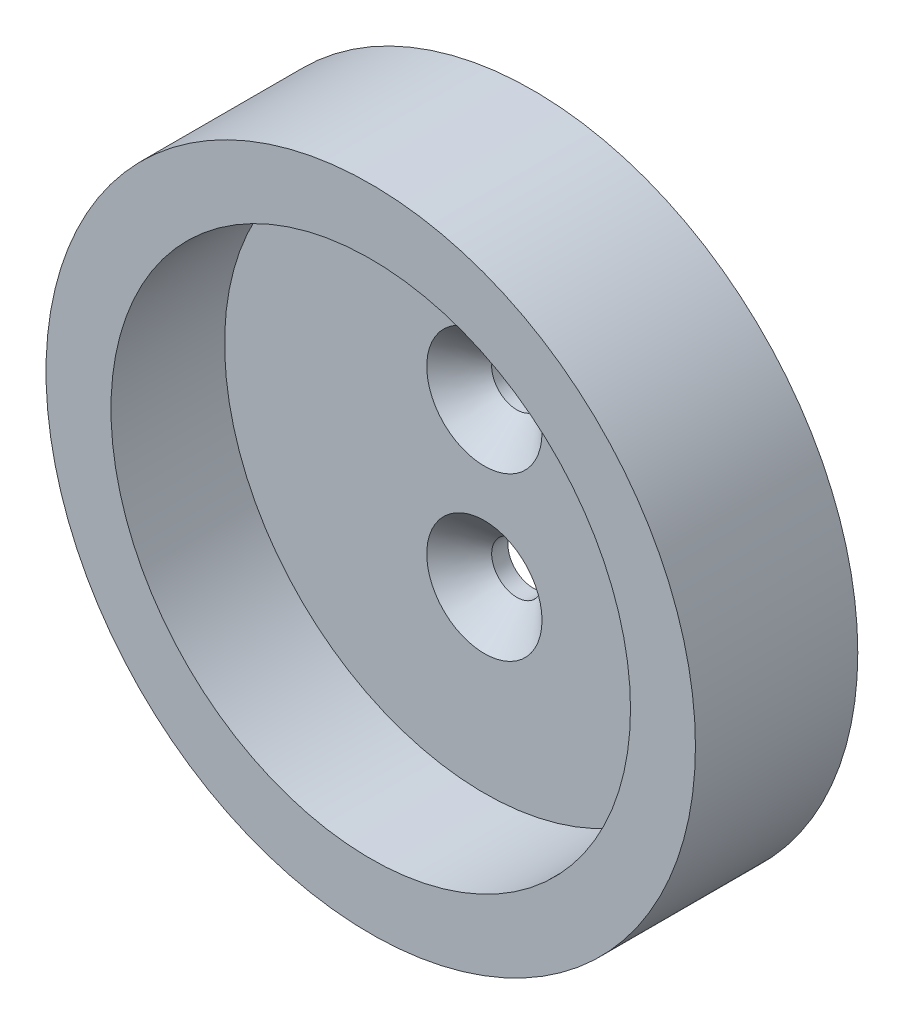
ISO-10303-21;
HEADER;
FILE_DESCRIPTION(('STEP AP214'),'2;1');
FILE_NAME('part.step','',(''),(''),'','','');
FILE_SCHEMA(('AUTOMOTIVE_DESIGN { 1 0 10303 214 1 1 1 1 }'));
ENDSEC;
DATA;
#1=APPLICATION_CONTEXT('core data for automotive mechanical design processes');
#2=APPLICATION_PROTOCOL_DEFINITION('international standard','automotive_design',2000,#1);
#3=PRODUCT_CONTEXT('',#1,'mechanical');
#4=PRODUCT('Part','Part','',(#3));
#5=PRODUCT_RELATED_PRODUCT_CATEGORY('part','',(#4));
#6=PRODUCT_DEFINITION_FORMATION('','',#4);
#7=PRODUCT_DEFINITION_CONTEXT('part definition',#1,'design');
#8=PRODUCT_DEFINITION('design','',#6,#7);
#9=PRODUCT_DEFINITION_SHAPE('','',#8);
#10=(LENGTH_UNIT() NAMED_UNIT(*) SI_UNIT(.MILLI.,.METRE.));
#11=(NAMED_UNIT(*) PLANE_ANGLE_UNIT() SI_UNIT($,.RADIAN.));
#12=(NAMED_UNIT(*) SI_UNIT($,.STERADIAN.) SOLID_ANGLE_UNIT());
#13=UNCERTAINTY_MEASURE_WITH_UNIT(LENGTH_MEASURE(1.E-05),#10,'distance_accuracy_value','');
#14=(GEOMETRIC_REPRESENTATION_CONTEXT(3) GLOBAL_UNCERTAINTY_ASSIGNED_CONTEXT((#13)) GLOBAL_UNIT_ASSIGNED_CONTEXT((#10,
#11,#12)) REPRESENTATION_CONTEXT('',''));
#15=CARTESIAN_POINT('',(0.,0.,0.));
#16=DIRECTION('',(0.,0.,1.));
#17=DIRECTION('',(1.,0.,0.));
#18=AXIS2_PLACEMENT_3D('',#15,#16,#17);
#19=CARTESIAN_POINT('',(0.,0.,10.));
#20=DIRECTION('',(0.,0.,-1.));
#21=DIRECTION('',(-1.,0.,0.));
#22=AXIS2_PLACEMENT_3D('',#19,#20,#21);
#23=CYLINDRICAL_SURFACE('',#22,20.);
#24=CARTESIAN_POINT('',(0.,0.,10.));
#25=DIRECTION('',(0.,0.,1.));
#26=DIRECTION('',(1.,0.,0.));
#27=AXIS2_PLACEMENT_3D('',#24,#25,#26);
#28=CIRCLE('',#27,20.);
#29=CARTESIAN_POINT('',(20.,0.,10.));
#30=VERTEX_POINT('',#29);
#31=EDGE_CURVE('E50',#30,#30,#28,.T.);
#32=ORIENTED_EDGE('',*,*,#31,.F.);
#33=EDGE_LOOP('',(#32));
#34=FACE_BOUND('',#33,.T.);
#35=CARTESIAN_POINT('',(0.,0.,0.));
#36=DIRECTION('',(0.,0.,1.));
#37=DIRECTION('',(1.,0.,0.));
#38=AXIS2_PLACEMENT_3D('',#35,#36,#37);
#39=CIRCLE('',#38,20.);
#40=CARTESIAN_POINT('',(20.,0.,0.));
#41=VERTEX_POINT('',#40);
#42=EDGE_CURVE('E51',#41,#41,#39,.T.);
#43=ORIENTED_EDGE('',*,*,#42,.T.);
#44=EDGE_LOOP('',(#43));
#45=FACE_BOUND('',#44,.T.);
#46=ADVANCED_FACE('F30',(#34,#45),#23,.T.);
#47=CARTESIAN_POINT('',(0.,0.,10.));
#48=DIRECTION('',(0.,0.,1.));
#49=DIRECTION('',(1.,0.,0.));
#50=AXIS2_PLACEMENT_3D('',#47,#48,#49);
#51=PLANE('',#50);
#52=CARTESIAN_POINT('',(0.,0.,10.));
#53=DIRECTION('',(0.,0.,1.));
#54=DIRECTION('',(1.,0.,0.));
#55=AXIS2_PLACEMENT_3D('',#52,#53,#54);
#56=CIRCLE('',#55,16.);
#57=CARTESIAN_POINT('',(16.,0.,10.));
#58=VERTEX_POINT('',#57);
#59=EDGE_CURVE('E57',#58,#58,#56,.T.);
#60=ORIENTED_EDGE('',*,*,#59,.F.);
#61=EDGE_LOOP('',(#60));
#62=FACE_BOUND('',#61,.T.);
#63=ORIENTED_EDGE('',*,*,#31,.T.);
#64=EDGE_LOOP('',(#63));
#65=FACE_BOUND('',#64,.T.);
#66=ADVANCED_FACE('F86',(#62,#65),#51,.T.);
#67=CARTESIAN_POINT('',(0.,0.,0.));
#68=DIRECTION('',(0.,0.,1.));
#69=DIRECTION('',(1.,0.,0.));
#70=AXIS2_PLACEMENT_3D('',#67,#68,#69);
#71=PLANE('',#70);
#72=CARTESIAN_POINT('',(0.,5.,0.));
#73=DIRECTION('',(0.,0.,1.));
#74=DIRECTION('',(-1.,0.,0.));
#75=AXIS2_PLACEMENT_3D('',#72,#73,#74);
#76=CIRCLE('',#75,1.55);
#77=CARTESIAN_POINT('',(-1.55,5.,0.));
#78=VERTEX_POINT('',#77);
#79=EDGE_CURVE('E65',#78,#78,#76,.T.);
#80=ORIENTED_EDGE('',*,*,#79,.T.);
#81=EDGE_LOOP('',(#80));
#82=FACE_BOUND('',#81,.T.);
#83=CARTESIAN_POINT('',(0.,-5.,0.));
#84=DIRECTION('',(0.,0.,1.));
#85=DIRECTION('',(1.,0.,0.));
#86=AXIS2_PLACEMENT_3D('',#83,#84,#85);
#87=CIRCLE('',#86,1.55);
#88=CARTESIAN_POINT('',(1.55,-5.,0.));
#89=VERTEX_POINT('',#88);
#90=EDGE_CURVE('E60',#89,#89,#87,.T.);
#91=ORIENTED_EDGE('',*,*,#90,.T.);
#92=EDGE_LOOP('',(#91));
#93=FACE_BOUND('',#92,.T.);
#94=ORIENTED_EDGE('',*,*,#42,.F.);
#95=EDGE_LOOP('',(#94));
#96=FACE_BOUND('',#95,.T.);
#97=ADVANCED_FACE('F69',(#82,#93,#96),#71,.F.);
#98=CARTESIAN_POINT('',(0.,0.,3.));
#99=DIRECTION('',(0.,0.,1.));
#100=DIRECTION('',(1.,0.,0.));
#101=AXIS2_PLACEMENT_3D('',#98,#99,#100);
#102=CYLINDRICAL_SURFACE('',#101,16.);
#103=CARTESIAN_POINT('',(0.,0.,3.));
#104=DIRECTION('',(0.,0.,1.));
#105=DIRECTION('',(1.,0.,0.));
#106=AXIS2_PLACEMENT_3D('',#103,#104,#105);
#107=CIRCLE('',#106,16.);
#108=CARTESIAN_POINT('',(16.,0.,3.));
#109=VERTEX_POINT('',#108);
#110=EDGE_CURVE('E54',#109,#109,#107,.T.);
#111=ORIENTED_EDGE('',*,*,#110,.F.);
#112=EDGE_LOOP('',(#111));
#113=FACE_BOUND('',#112,.T.);
#114=ORIENTED_EDGE('',*,*,#59,.T.);
#115=EDGE_LOOP('',(#114));
#116=FACE_BOUND('',#115,.T.);
#117=ADVANCED_FACE('F98',(#113,#116),#102,.F.);
#118=CARTESIAN_POINT('',(0.,0.,3.));
#119=DIRECTION('',(0.,0.,1.));
#120=DIRECTION('',(1.,0.,0.));
#121=AXIS2_PLACEMENT_3D('',#118,#119,#120);
#122=PLANE('',#121);
#123=CARTESIAN_POINT('',(0.,-5.,3.));
#124=DIRECTION('',(0.,0.,1.));
#125=DIRECTION('',(1.,0.,0.));
#126=AXIS2_PLACEMENT_3D('',#123,#124,#125);
#127=CIRCLE('',#126,3.55);
#128=CARTESIAN_POINT('',(3.55,-5.,3.));
#129=VERTEX_POINT('',#128);
#130=EDGE_CURVE('E37',#129,#129,#127,.F.);
#131=ORIENTED_EDGE('',*,*,#130,.T.);
#132=EDGE_LOOP('',(#131));
#133=FACE_BOUND('',#132,.T.);
#134=CARTESIAN_POINT('',(0.,5.,3.));
#135=DIRECTION('',(0.,0.,1.));
#136=DIRECTION('',(1.,0.,0.));
#137=AXIS2_PLACEMENT_3D('',#134,#135,#136);
#138=CIRCLE('',#137,3.55);
#139=CARTESIAN_POINT('',(3.55,5.,3.));
#140=VERTEX_POINT('',#139);
#141=EDGE_CURVE('E41',#140,#140,#138,.F.);
#142=ORIENTED_EDGE('',*,*,#141,.T.);
#143=EDGE_LOOP('',(#142));
#144=FACE_BOUND('',#143,.T.);
#145=ORIENTED_EDGE('',*,*,#110,.T.);
#146=EDGE_LOOP('',(#145));
#147=FACE_BOUND('',#146,.T.);
#148=ADVANCED_FACE('F82',(#133,#144,#147),#122,.T.);
#149=CARTESIAN_POINT('',(0.,-5.,0.));
#150=DIRECTION('',(0.,0.,1.));
#151=DIRECTION('',(1.,0.,0.));
#152=AXIS2_PLACEMENT_3D('',#149,#150,#151);
#153=CYLINDRICAL_SURFACE('',#152,1.55);
#154=CARTESIAN_POINT('',(0.,-5.,1.));
#155=DIRECTION('',(0.,0.,1.));
#156=DIRECTION('',(1.,0.,0.));
#157=AXIS2_PLACEMENT_3D('',#154,#155,#156);
#158=CIRCLE('',#157,1.55);
#159=CARTESIAN_POINT('',(1.55,-5.,1.));
#160=VERTEX_POINT('',#159);
#161=EDGE_CURVE('E45',#160,#160,#158,.T.);
#162=ORIENTED_EDGE('',*,*,#161,.T.);
#163=EDGE_LOOP('',(#162));
#164=FACE_BOUND('',#163,.T.);
#165=ORIENTED_EDGE('',*,*,#90,.F.);
#166=EDGE_LOOP('',(#165));
#167=FACE_BOUND('',#166,.T.);
#168=ADVANCED_FACE('F75',(#164,#167),#153,.F.);
#169=CARTESIAN_POINT('',(0.,5.,0.));
#170=DIRECTION('',(0.,0.,1.));
#171=DIRECTION('',(1.,0.,0.));
#172=AXIS2_PLACEMENT_3D('',#169,#170,#171);
#173=CYLINDRICAL_SURFACE('',#172,1.55);
#174=CARTESIAN_POINT('',(0.,5.,1.));
#175=DIRECTION('',(0.,0.,1.));
#176=DIRECTION('',(1.,0.,0.));
#177=AXIS2_PLACEMENT_3D('',#174,#175,#176);
#178=CIRCLE('',#177,1.55);
#179=CARTESIAN_POINT('',(1.55,5.,1.));
#180=VERTEX_POINT('',#179);
#181=EDGE_CURVE('E10',#180,#180,#178,.T.);
#182=ORIENTED_EDGE('',*,*,#181,.T.);
#183=EDGE_LOOP('',(#182));
#184=FACE_BOUND('',#183,.T.);
#185=ORIENTED_EDGE('',*,*,#79,.F.);
#186=EDGE_LOOP('',(#185));
#187=FACE_BOUND('',#186,.T.);
#188=ADVANCED_FACE('F72',(#184,#187),#173,.F.);
#189=CARTESIAN_POINT('',(0.,-5.,1.));
#190=DIRECTION('',(0.,0.,1.));
#191=DIRECTION('',(1.,0.,0.));
#192=AXIS2_PLACEMENT_3D('',#189,#190,#191);
#193=CONICAL_SURFACE('',#192,1.55,0.78539816339745);
#194=ORIENTED_EDGE('',*,*,#130,.F.);
#195=EDGE_LOOP('',(#194));
#196=FACE_BOUND('',#195,.T.);
#197=ORIENTED_EDGE('',*,*,#161,.F.);
#198=EDGE_LOOP('',(#197));
#199=FACE_BOUND('',#198,.T.);
#200=ADVANCED_FACE('F74',(#196,#199),#193,.F.);
#201=CARTESIAN_POINT('',(0.,5.,1.));
#202=DIRECTION('',(0.,0.,1.));
#203=DIRECTION('',(1.,0.,0.));
#204=AXIS2_PLACEMENT_3D('',#201,#202,#203);
#205=CONICAL_SURFACE('',#204,1.55,0.78539816339745);
#206=ORIENTED_EDGE('',*,*,#141,.F.);
#207=EDGE_LOOP('',(#206));
#208=FACE_BOUND('',#207,.T.);
#209=ORIENTED_EDGE('',*,*,#181,.F.);
#210=EDGE_LOOP('',(#209));
#211=FACE_BOUND('',#210,.T.);
#212=ADVANCED_FACE('F32',(#208,#211),#205,.F.);
#213=CLOSED_SHELL('',(#46,#66,#97,#117,#148,#168,#188,#200,#212));
#214=MANIFOLD_SOLID_BREP('B2',#213);
#215=ADVANCED_BREP_SHAPE_REPRESENTATION('',(#18,#214),#14);
#216=SHAPE_DEFINITION_REPRESENTATION(#9,#215);
ENDSEC;
END-ISO-10303-21;
